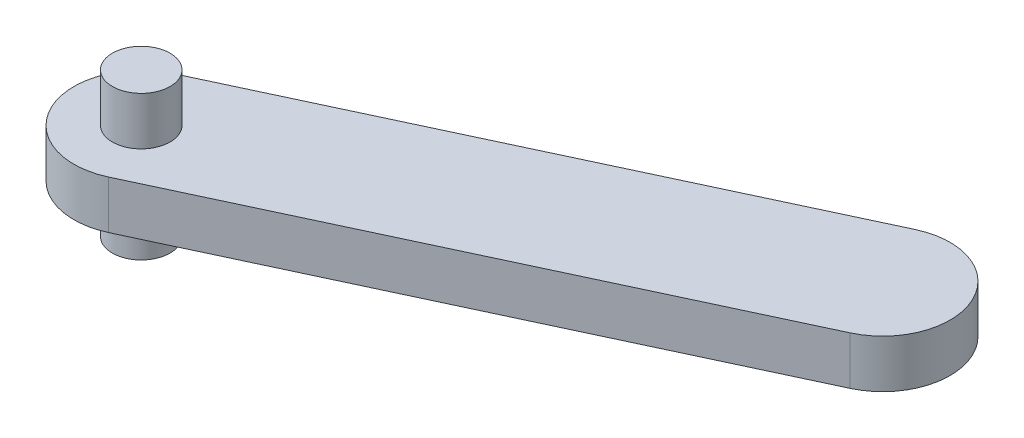
ISO-10303-21;
HEADER;
FILE_DESCRIPTION(('STEP AP214'),'2;1');
FILE_NAME('part.step','',(''),(''),'','','');
FILE_SCHEMA(('AUTOMOTIVE_DESIGN { 1 0 10303 214 1 1 1 1 }'));
ENDSEC;
DATA;
#1=APPLICATION_CONTEXT('core data for automotive mechanical design processes');
#2=APPLICATION_PROTOCOL_DEFINITION('international standard','automotive_design',2000,#1);
#3=PRODUCT_CONTEXT('',#1,'mechanical');
#4=PRODUCT('Part','Part','',(#3));
#5=PRODUCT_RELATED_PRODUCT_CATEGORY('part','',(#4));
#6=PRODUCT_DEFINITION_FORMATION('','',#4);
#7=PRODUCT_DEFINITION_CONTEXT('part definition',#1,'design');
#8=PRODUCT_DEFINITION('design','',#6,#7);
#9=PRODUCT_DEFINITION_SHAPE('','',#8);
#10=(LENGTH_UNIT() NAMED_UNIT(*) SI_UNIT(.MILLI.,.METRE.));
#11=(NAMED_UNIT(*) PLANE_ANGLE_UNIT() SI_UNIT($,.RADIAN.));
#12=(NAMED_UNIT(*) SI_UNIT($,.STERADIAN.) SOLID_ANGLE_UNIT());
#13=UNCERTAINTY_MEASURE_WITH_UNIT(LENGTH_MEASURE(1.E-05),#10,'distance_accuracy_value','');
#14=(GEOMETRIC_REPRESENTATION_CONTEXT(3) GLOBAL_UNCERTAINTY_ASSIGNED_CONTEXT((#13)) GLOBAL_UNIT_ASSIGNED_CONTEXT((#10,
#11,#12)) REPRESENTATION_CONTEXT('',''));
#15=CARTESIAN_POINT('',(0.,0.,0.));
#16=DIRECTION('',(0.,0.,1.));
#17=DIRECTION('',(1.,0.,0.));
#18=AXIS2_PLACEMENT_3D('',#15,#16,#17);
#19=CARTESIAN_POINT('',(556.901560726433,165.,-280.835669279043));
#20=DIRECTION('',(0.,1.,0.));
#21=DIRECTION('',(1.,0.,0.));
#22=AXIS2_PLACEMENT_3D('',#19,#20,#21);
#23=PLANE('',#22);
#24=CARTESIAN_POINT('',(425.486931606119,165.,-219.556021326642));
#25=DIRECTION('',(0.,1.,0.));
#26=DIRECTION('',(1.,0.,0.));
#27=AXIS2_PLACEMENT_3D('',#24,#25,#26);
#28=CIRCLE('',#27,15.);
#29=CARTESIAN_POINT('',(410.486931606119,165.,-219.556021326642));
#30=VERTEX_POINT('',#29);
#31=EDGE_CURVE('E132',#30,#30,#28,.T.);
#32=ORIENTED_EDGE('',*,*,#31,.T.);
#33=EDGE_LOOP('',(#32));
#34=FACE_BOUND('',#33,.T.);
#35=DIRECTION('',(0.90630778703665,0.,-0.422618261740699));
#36=VECTOR('',#35,1.);
#37=CARTESIAN_POINT('',(607.817236125666,165.,-343.196265801526));
#38=LINE('',#37,#36);
#39=CARTESIAN_POINT('',(410.695292445195,165.,-251.276793872924));
#40=VERTEX_POINT('',#39);
#41=CARTESIAN_POINT('',(673.524550685823,165.,-373.836089777727));
#42=VERTEX_POINT('',#41);
#43=EDGE_CURVE('E28',#40,#42,#38,.T.);
#44=ORIENTED_EDGE('',*,*,#43,.T.);
#45=CARTESIAN_POINT('',(688.316189846748,165.,-342.115317231444));
#46=DIRECTION('',(0.,-1.,0.));
#47=DIRECTION('',(0.422618261740702,0.,0.906307787036649));
#48=AXIS2_PLACEMENT_3D('',#45,#46,#47);
#49=CIRCLE('',#48,35.);
#50=CARTESIAN_POINT('',(703.107829007672,165.,-310.394544685161));
#51=VERTEX_POINT('',#50);
#52=EDGE_CURVE('E139',#42,#51,#49,.T.);
#53=ORIENTED_EDGE('',*,*,#52,.T.);
#54=DIRECTION('',(-0.906307787036651,0.,0.422618261740698));
#55=VECTOR('',#54,1.);
#56=CARTESIAN_POINT('',(505.985885327201,165.,-218.475072756559));
#57=LINE('',#56,#55);
#58=CARTESIAN_POINT('',(440.278570767043,165.,-187.835248780359));
#59=VERTEX_POINT('',#58);
#60=EDGE_CURVE('E112',#51,#59,#57,.T.);
#61=ORIENTED_EDGE('',*,*,#60,.T.);
#62=CARTESIAN_POINT('',(425.486931606119,165.,-219.556021326642));
#63=DIRECTION('',(0.,-1.,0.));
#64=DIRECTION('',(-0.422618261740698,0.,-0.906307787036651));
#65=AXIS2_PLACEMENT_3D('',#62,#63,#64);
#66=CIRCLE('',#65,35.);
#67=EDGE_CURVE('E100',#59,#40,#66,.T.);
#68=ORIENTED_EDGE('',*,*,#67,.T.);
#69=EDGE_LOOP('',(#44,#53,#61,#68));
#70=FACE_BOUND('',#69,.T.);
#71=ADVANCED_FACE('F17',(#34,#70),#23,.F.);
#72=CARTESIAN_POINT('',(556.901560726433,190.,-280.835669279043));
#73=DIRECTION('',(0.,1.,0.));
#74=DIRECTION('',(1.,0.,0.));
#75=AXIS2_PLACEMENT_3D('',#72,#73,#74);
#76=PLANE('',#75);
#77=CARTESIAN_POINT('',(425.486931606119,190.,-219.556021326642));
#78=DIRECTION('',(0.,-1.,0.));
#79=DIRECTION('',(1.,0.,0.));
#80=AXIS2_PLACEMENT_3D('',#77,#78,#79);
#81=CIRCLE('',#80,15.);
#82=CARTESIAN_POINT('',(410.486931606119,190.,-219.556021326642));
#83=VERTEX_POINT('',#82);
#84=EDGE_CURVE('E66',#83,#83,#81,.T.);
#85=ORIENTED_EDGE('',*,*,#84,.T.);
#86=EDGE_LOOP('',(#85));
#87=FACE_BOUND('',#86,.T.);
#88=DIRECTION('',(-0.90630778703665,0.,0.422618261740699));
#89=VECTOR('',#88,1.);
#90=CARTESIAN_POINT('',(607.817236125666,190.,-343.196265801526));
#91=LINE('',#90,#89);
#92=CARTESIAN_POINT('',(673.524550685823,190.,-373.836089777727));
#93=VERTEX_POINT('',#92);
#94=CARTESIAN_POINT('',(410.695292445195,190.,-251.276793872924));
#95=VERTEX_POINT('',#94);
#96=EDGE_CURVE('E11',#93,#95,#91,.T.);
#97=ORIENTED_EDGE('',*,*,#96,.T.);
#98=CARTESIAN_POINT('',(425.486931606119,190.,-219.556021326642));
#99=DIRECTION('',(0.,1.,0.));
#100=DIRECTION('',(-0.422618261740698,0.,-0.906307787036651));
#101=AXIS2_PLACEMENT_3D('',#98,#99,#100);
#102=CIRCLE('',#101,35.);
#103=CARTESIAN_POINT('',(440.278570767043,190.,-187.835248780359));
#104=VERTEX_POINT('',#103);
#105=EDGE_CURVE('E90',#95,#104,#102,.T.);
#106=ORIENTED_EDGE('',*,*,#105,.T.);
#107=DIRECTION('',(0.906307787036651,0.,-0.422618261740698));
#108=VECTOR('',#107,1.);
#109=CARTESIAN_POINT('',(505.985885327201,190.,-218.475072756559));
#110=LINE('',#109,#108);
#111=CARTESIAN_POINT('',(703.107829007672,190.,-310.394544685161));
#112=VERTEX_POINT('',#111);
#113=EDGE_CURVE('E94',#104,#112,#110,.T.);
#114=ORIENTED_EDGE('',*,*,#113,.T.);
#115=CARTESIAN_POINT('',(688.316189846748,190.,-342.115317231444));
#116=DIRECTION('',(0.,1.,0.));
#117=DIRECTION('',(0.422618261740702,0.,0.906307787036649));
#118=AXIS2_PLACEMENT_3D('',#115,#116,#117);
#119=CIRCLE('',#118,35.);
#120=EDGE_CURVE('E21',#112,#93,#119,.T.);
#121=ORIENTED_EDGE('',*,*,#120,.T.);
#122=EDGE_LOOP('',(#97,#106,#114,#121));
#123=FACE_BOUND('',#122,.T.);
#124=ADVANCED_FACE('F92',(#87,#123),#76,.T.);
#125=CARTESIAN_POINT('',(673.524550685823,165.,-373.836089777727));
#126=DIRECTION('',(-0.422618261740699,0.,-0.90630778703665));
#127=DIRECTION('',(-0.90630778703665,0.,0.422618261740699));
#128=AXIS2_PLACEMENT_3D('',#125,#126,#127);
#129=PLANE('',#128);
#130=ORIENTED_EDGE('',*,*,#43,.F.);
#131=DIRECTION('',(0.,1.,0.));
#132=VECTOR('',#131,1.);
#133=CARTESIAN_POINT('',(410.695292445195,165.,-251.276793872924));
#134=LINE('',#133,#132);
#135=EDGE_CURVE('E99',#40,#95,#134,.T.);
#136=ORIENTED_EDGE('',*,*,#135,.T.);
#137=ORIENTED_EDGE('',*,*,#96,.F.);
#138=DIRECTION('',(0.,1.,0.));
#139=VECTOR('',#138,1.);
#140=CARTESIAN_POINT('',(673.524550685823,165.,-373.836089777727));
#141=LINE('',#140,#139);
#142=EDGE_CURVE('E142',#42,#93,#141,.T.);
#143=ORIENTED_EDGE('',*,*,#142,.F.);
#144=EDGE_LOOP('',(#130,#136,#137,#143));
#145=FACE_BOUND('',#144,.T.);
#146=ADVANCED_FACE('F169',(#145),#129,.T.);
#147=CARTESIAN_POINT('',(425.486931606119,165.,-219.556021326642));
#148=DIRECTION('',(0.,1.,0.));
#149=DIRECTION('',(-0.422618261740698,0.,-0.906307787036651));
#150=AXIS2_PLACEMENT_3D('',#147,#148,#149);
#151=CYLINDRICAL_SURFACE('',#150,35.);
#152=ORIENTED_EDGE('',*,*,#67,.F.);
#153=DIRECTION('',(0.,1.,0.));
#154=VECTOR('',#153,1.);
#155=CARTESIAN_POINT('',(440.278570767043,165.,-187.835248780359));
#156=LINE('',#155,#154);
#157=EDGE_CURVE('E102',#59,#104,#156,.T.);
#158=ORIENTED_EDGE('',*,*,#157,.T.);
#159=ORIENTED_EDGE('',*,*,#105,.F.);
#160=ORIENTED_EDGE('',*,*,#135,.F.);
#161=EDGE_LOOP('',(#152,#158,#159,#160));
#162=FACE_BOUND('',#161,.T.);
#163=ADVANCED_FACE('F103',(#162),#151,.T.);
#164=CARTESIAN_POINT('',(440.278570767043,165.,-187.835248780359));
#165=DIRECTION('',(0.422618261740698,0.,0.906307787036651));
#166=DIRECTION('',(0.,-1.,0.));
#167=AXIS2_PLACEMENT_3D('',#164,#165,#166);
#168=PLANE('',#167);
#169=ORIENTED_EDGE('',*,*,#60,.F.);
#170=DIRECTION('',(0.,1.,0.));
#171=VECTOR('',#170,1.);
#172=CARTESIAN_POINT('',(703.107829007672,165.,-310.394544685161));
#173=LINE('',#172,#171);
#174=EDGE_CURVE('E109',#51,#112,#173,.T.);
#175=ORIENTED_EDGE('',*,*,#174,.T.);
#176=ORIENTED_EDGE('',*,*,#113,.F.);
#177=ORIENTED_EDGE('',*,*,#157,.F.);
#178=EDGE_LOOP('',(#169,#175,#176,#177));
#179=FACE_BOUND('',#178,.T.);
#180=ADVANCED_FACE('F19',(#179),#168,.T.);
#181=CARTESIAN_POINT('',(688.316189846748,165.,-342.115317231444));
#182=DIRECTION('',(0.,1.,0.));
#183=DIRECTION('',(0.422618261740702,0.,0.906307787036649));
#184=AXIS2_PLACEMENT_3D('',#181,#182,#183);
#185=CYLINDRICAL_SURFACE('',#184,35.);
#186=ORIENTED_EDGE('',*,*,#52,.F.);
#187=ORIENTED_EDGE('',*,*,#142,.T.);
#188=ORIENTED_EDGE('',*,*,#120,.F.);
#189=ORIENTED_EDGE('',*,*,#174,.F.);
#190=EDGE_LOOP('',(#186,#187,#188,#189));
#191=FACE_BOUND('',#190,.T.);
#192=ADVANCED_FACE('F177',(#191),#185,.T.);
#193=CARTESIAN_POINT('',(425.486931606119,215.,-219.556021326642));
#194=DIRECTION('',(0.,1.,0.));
#195=DIRECTION('',(1.,0.,0.));
#196=AXIS2_PLACEMENT_3D('',#193,#194,#195);
#197=PLANE('',#196);
#198=CARTESIAN_POINT('',(425.486931606119,215.,-219.556021326642));
#199=DIRECTION('',(0.,-1.,0.));
#200=DIRECTION('',(1.,0.,0.));
#201=AXIS2_PLACEMENT_3D('',#198,#199,#200);
#202=CIRCLE('',#201,15.);
#203=CARTESIAN_POINT('',(410.486931606119,215.,-219.556021326642));
#204=VERTEX_POINT('',#203);
#205=EDGE_CURVE('E121',#204,#204,#202,.T.);
#206=ORIENTED_EDGE('',*,*,#205,.F.);
#207=EDGE_LOOP('',(#206));
#208=FACE_BOUND('',#207,.T.);
#209=ADVANCED_FACE('F180',(#208),#197,.T.);
#210=CARTESIAN_POINT('',(425.486931606119,140.,-219.556021326642));
#211=DIRECTION('',(0.,-1.,0.));
#212=DIRECTION('',(0.,0.,-1.));
#213=AXIS2_PLACEMENT_3D('',#210,#211,#212);
#214=PLANE('',#213);
#215=CARTESIAN_POINT('',(425.486931606119,140.,-219.556021326642));
#216=DIRECTION('',(0.,1.,0.));
#217=DIRECTION('',(1.,0.,0.));
#218=AXIS2_PLACEMENT_3D('',#215,#216,#217);
#219=CIRCLE('',#218,15.);
#220=CARTESIAN_POINT('',(410.486931606119,140.,-219.556021326642));
#221=VERTEX_POINT('',#220);
#222=EDGE_CURVE('E154',#221,#221,#219,.T.);
#223=ORIENTED_EDGE('',*,*,#222,.F.);
#224=EDGE_LOOP('',(#223));
#225=FACE_BOUND('',#224,.T.);
#226=ADVANCED_FACE('F172',(#225),#214,.T.);
#227=CARTESIAN_POINT('',(425.486931606119,140.,-219.556021326642));
#228=DIRECTION('',(0.,1.,0.));
#229=DIRECTION('',(1.,0.,0.));
#230=AXIS2_PLACEMENT_3D('',#227,#228,#229);
#231=CYLINDRICAL_SURFACE('',#230,15.);
#232=ORIENTED_EDGE('',*,*,#205,.T.);
#233=DIRECTION('',(0.,-1.,0.));
#234=VECTOR('',#233,1.);
#235=CARTESIAN_POINT('',(410.486931606119,140.,-219.556021326642));
#236=LINE('',#235,#234);
#237=EDGE_CURVE('E124',#204,#83,#236,.T.);
#238=ORIENTED_EDGE('',*,*,#237,.T.);
#239=ORIENTED_EDGE('',*,*,#84,.F.);
#240=ORIENTED_EDGE('',*,*,#237,.F.);
#241=EDGE_LOOP('',(#232,#238,#239,#240));
#242=FACE_BOUND('',#241,.T.);
#243=ADVANCED_FACE('F173',(#242),#231,.T.);
#244=CARTESIAN_POINT('',(425.486931606119,140.,-219.556021326642));
#245=DIRECTION('',(0.,1.,0.));
#246=DIRECTION('',(1.,0.,0.));
#247=AXIS2_PLACEMENT_3D('',#244,#245,#246);
#248=CYLINDRICAL_SURFACE('',#247,15.);
#249=ORIENTED_EDGE('',*,*,#31,.F.);
#250=DIRECTION('',(0.,-1.,0.));
#251=VECTOR('',#250,1.);
#252=CARTESIAN_POINT('',(410.486931606119,140.,-219.556021326642));
#253=LINE('',#252,#251);
#254=EDGE_CURVE('E135',#30,#221,#253,.T.);
#255=ORIENTED_EDGE('',*,*,#254,.T.);
#256=ORIENTED_EDGE('',*,*,#222,.T.);
#257=ORIENTED_EDGE('',*,*,#254,.F.);
#258=EDGE_LOOP('',(#249,#255,#256,#257));
#259=FACE_BOUND('',#258,.T.);
#260=ADVANCED_FACE('F160',(#259),#248,.T.);
#261=CLOSED_SHELL('',(#71,#124,#146,#163,#180,#192,#209,#226,#243,#260));
#262=MANIFOLD_SOLID_BREP('B1',#261);
#263=ADVANCED_BREP_SHAPE_REPRESENTATION('',(#18,#262),#14);
#264=SHAPE_DEFINITION_REPRESENTATION(#9,#263);
ENDSEC;
END-ISO-10303-21;
